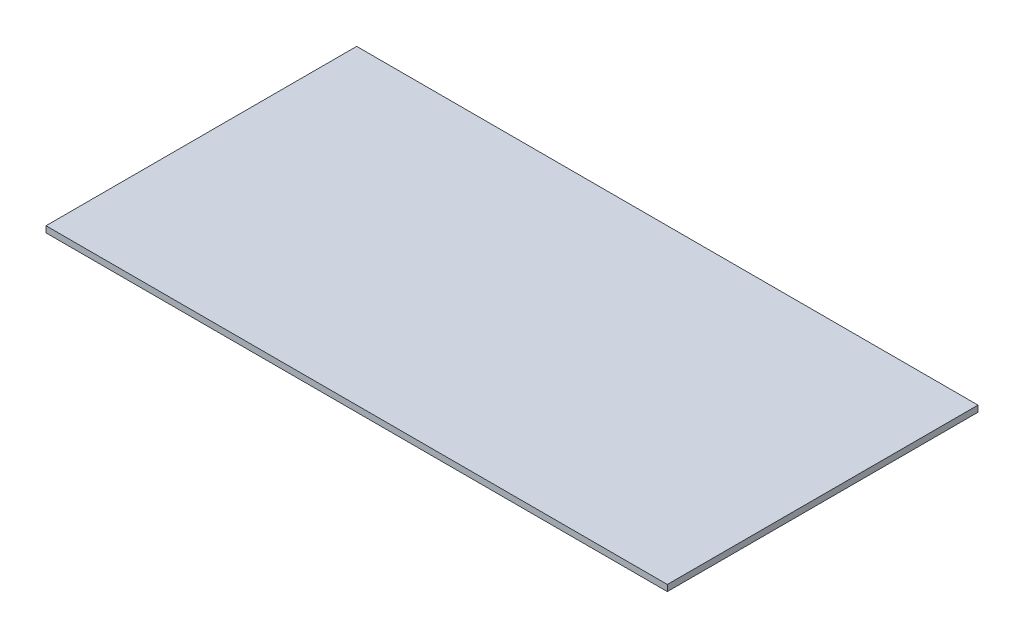
ISO-10303-21;
HEADER;
FILE_DESCRIPTION(('STEP AP214'),'2;1');
FILE_NAME('part.step','',(''),(''),'','','');
FILE_SCHEMA(('AUTOMOTIVE_DESIGN { 1 0 10303 214 1 1 1 1 }'));
ENDSEC;
DATA;
#1=APPLICATION_CONTEXT('core data for automotive mechanical design processes');
#2=APPLICATION_PROTOCOL_DEFINITION('international standard','automotive_design',2000,#1);
#3=PRODUCT_CONTEXT('',#1,'mechanical');
#4=PRODUCT('Part','Part','',(#3));
#5=PRODUCT_RELATED_PRODUCT_CATEGORY('part','',(#4));
#6=PRODUCT_DEFINITION_FORMATION('','',#4);
#7=PRODUCT_DEFINITION_CONTEXT('part definition',#1,'design');
#8=PRODUCT_DEFINITION('design','',#6,#7);
#9=PRODUCT_DEFINITION_SHAPE('','',#8);
#10=(LENGTH_UNIT() NAMED_UNIT(*) SI_UNIT(.MILLI.,.METRE.));
#11=(NAMED_UNIT(*) PLANE_ANGLE_UNIT() SI_UNIT($,.RADIAN.));
#12=(NAMED_UNIT(*) SI_UNIT($,.STERADIAN.) SOLID_ANGLE_UNIT());
#13=UNCERTAINTY_MEASURE_WITH_UNIT(LENGTH_MEASURE(1.E-05),#10,'distance_accuracy_value','');
#14=(GEOMETRIC_REPRESENTATION_CONTEXT(3) GLOBAL_UNCERTAINTY_ASSIGNED_CONTEXT((#13)) GLOBAL_UNIT_ASSIGNED_CONTEXT((#10,
#11,#12)) REPRESENTATION_CONTEXT('',''));
#15=CARTESIAN_POINT('',(0.,0.,0.));
#16=DIRECTION('',(0.,0.,1.));
#17=DIRECTION('',(1.,0.,0.));
#18=AXIS2_PLACEMENT_3D('',#15,#16,#17);
#19=CARTESIAN_POINT('',(500.,10.,-250.));
#20=DIRECTION('',(-1.,0.,0.));
#21=DIRECTION('',(0.,0.,1.));
#22=AXIS2_PLACEMENT_3D('',#19,#20,#21);
#23=PLANE('',#22);
#24=DIRECTION('',(0.,0.,-1.));
#25=VECTOR('',#24,1.);
#26=CARTESIAN_POINT('',(500.,0.,-250.));
#27=LINE('',#26,#25);
#28=CARTESIAN_POINT('',(500.,0.,250.));
#29=VERTEX_POINT('',#28);
#30=CARTESIAN_POINT('',(500.,0.,-250.));
#31=VERTEX_POINT('',#30);
#32=EDGE_CURVE('E100',#29,#31,#27,.T.);
#33=ORIENTED_EDGE('',*,*,#32,.T.);
#34=DIRECTION('',(0.,-1.,0.));
#35=VECTOR('',#34,1.);
#36=CARTESIAN_POINT('',(500.,10.,-250.));
#37=LINE('',#36,#35);
#38=CARTESIAN_POINT('',(500.,10.,-250.));
#39=VERTEX_POINT('',#38);
#40=EDGE_CURVE('E11',#39,#31,#37,.T.);
#41=ORIENTED_EDGE('',*,*,#40,.F.);
#42=DIRECTION('',(0.,0.,-1.));
#43=VECTOR('',#42,1.);
#44=CARTESIAN_POINT('',(500.,10.,-250.));
#45=LINE('',#44,#43);
#46=CARTESIAN_POINT('',(500.,10.,250.));
#47=VERTEX_POINT('',#46);
#48=EDGE_CURVE('E88',#47,#39,#45,.T.);
#49=ORIENTED_EDGE('',*,*,#48,.F.);
#50=DIRECTION('',(0.,-1.,0.));
#51=VECTOR('',#50,1.);
#52=CARTESIAN_POINT('',(500.,10.,250.));
#53=LINE('',#52,#51);
#54=EDGE_CURVE('E96',#47,#29,#53,.T.);
#55=ORIENTED_EDGE('',*,*,#54,.T.);
#56=EDGE_LOOP('',(#33,#41,#49,#55));
#57=FACE_BOUND('',#56,.T.);
#58=ADVANCED_FACE('F37',(#57),#23,.F.);
#59=CARTESIAN_POINT('',(-500.,10.,-250.));
#60=DIRECTION('',(0.,0.,1.));
#61=DIRECTION('',(1.,0.,0.));
#62=AXIS2_PLACEMENT_3D('',#59,#60,#61);
#63=PLANE('',#62);
#64=DIRECTION('',(-1.,0.,0.));
#65=VECTOR('',#64,1.);
#66=CARTESIAN_POINT('',(-500.,0.,-250.));
#67=LINE('',#66,#65);
#68=CARTESIAN_POINT('',(-500.,0.,-250.));
#69=VERTEX_POINT('',#68);
#70=EDGE_CURVE('E92',#31,#69,#67,.T.);
#71=ORIENTED_EDGE('',*,*,#70,.T.);
#72=DIRECTION('',(0.,-1.,0.));
#73=VECTOR('',#72,1.);
#74=CARTESIAN_POINT('',(-500.,10.,-250.));
#75=LINE('',#74,#73);
#76=CARTESIAN_POINT('',(-500.,10.,-250.));
#77=VERTEX_POINT('',#76);
#78=EDGE_CURVE('E45',#77,#69,#75,.T.);
#79=ORIENTED_EDGE('',*,*,#78,.F.);
#80=DIRECTION('',(-1.,0.,0.));
#81=VECTOR('',#80,1.);
#82=CARTESIAN_POINT('',(-500.,10.,-250.));
#83=LINE('',#82,#81);
#84=EDGE_CURVE('E83',#39,#77,#83,.T.);
#85=ORIENTED_EDGE('',*,*,#84,.F.);
#86=ORIENTED_EDGE('',*,*,#40,.T.);
#87=EDGE_LOOP('',(#71,#79,#85,#86));
#88=FACE_BOUND('',#87,.T.);
#89=ADVANCED_FACE('F91',(#88),#63,.F.);
#90=CARTESIAN_POINT('',(-500.,10.,-250.));
#91=DIRECTION('',(1.,0.,0.));
#92=DIRECTION('',(0.,0.,-1.));
#93=AXIS2_PLACEMENT_3D('',#90,#91,#92);
#94=PLANE('',#93);
#95=DIRECTION('',(0.,0.,1.));
#96=VECTOR('',#95,1.);
#97=CARTESIAN_POINT('',(-500.,0.,-250.));
#98=LINE('',#97,#96);
#99=CARTESIAN_POINT('',(-500.,0.,250.));
#100=VERTEX_POINT('',#99);
#101=EDGE_CURVE('E70',#69,#100,#98,.T.);
#102=ORIENTED_EDGE('',*,*,#101,.T.);
#103=DIRECTION('',(0.,-1.,0.));
#104=VECTOR('',#103,1.);
#105=CARTESIAN_POINT('',(-500.,10.,250.));
#106=LINE('',#105,#104);
#107=CARTESIAN_POINT('',(-500.,10.,250.));
#108=VERTEX_POINT('',#107);
#109=EDGE_CURVE('E93',#108,#100,#106,.T.);
#110=ORIENTED_EDGE('',*,*,#109,.F.);
#111=DIRECTION('',(0.,0.,1.));
#112=VECTOR('',#111,1.);
#113=CARTESIAN_POINT('',(-500.,10.,-250.));
#114=LINE('',#113,#112);
#115=EDGE_CURVE('E86',#77,#108,#114,.T.);
#116=ORIENTED_EDGE('',*,*,#115,.F.);
#117=ORIENTED_EDGE('',*,*,#78,.T.);
#118=EDGE_LOOP('',(#102,#110,#116,#117));
#119=FACE_BOUND('',#118,.T.);
#120=ADVANCED_FACE('F94',(#119),#94,.F.);
#121=CARTESIAN_POINT('',(-500.,10.,250.));
#122=DIRECTION('',(0.,0.,-1.));
#123=DIRECTION('',(-1.,0.,0.));
#124=AXIS2_PLACEMENT_3D('',#121,#122,#123);
#125=PLANE('',#124);
#126=DIRECTION('',(1.,0.,0.));
#127=VECTOR('',#126,1.);
#128=CARTESIAN_POINT('',(-500.,0.,250.));
#129=LINE('',#128,#127);
#130=EDGE_CURVE('E76',#100,#29,#129,.T.);
#131=ORIENTED_EDGE('',*,*,#130,.T.);
#132=ORIENTED_EDGE('',*,*,#54,.F.);
#133=DIRECTION('',(1.,0.,0.));
#134=VECTOR('',#133,1.);
#135=CARTESIAN_POINT('',(-500.,10.,250.));
#136=LINE('',#135,#134);
#137=EDGE_CURVE('E53',#108,#47,#136,.T.);
#138=ORIENTED_EDGE('',*,*,#137,.F.);
#139=ORIENTED_EDGE('',*,*,#109,.T.);
#140=EDGE_LOOP('',(#131,#132,#138,#139));
#141=FACE_BOUND('',#140,.T.);
#142=ADVANCED_FACE('F107',(#141),#125,.F.);
#143=CARTESIAN_POINT('',(0.,10.,0.));
#144=DIRECTION('',(0.,1.,0.));
#145=DIRECTION('',(0.,0.,1.));
#146=AXIS2_PLACEMENT_3D('',#143,#144,#145);
#147=PLANE('',#146);
#148=ORIENTED_EDGE('',*,*,#48,.T.);
#149=ORIENTED_EDGE('',*,*,#84,.T.);
#150=ORIENTED_EDGE('',*,*,#115,.T.);
#151=ORIENTED_EDGE('',*,*,#137,.T.);
#152=EDGE_LOOP('',(#148,#149,#150,#151));
#153=FACE_BOUND('',#152,.T.);
#154=ADVANCED_FACE('F84',(#153),#147,.T.);
#155=CARTESIAN_POINT('',(0.,0.,0.));
#156=DIRECTION('',(0.,1.,0.));
#157=DIRECTION('',(0.,0.,1.));
#158=AXIS2_PLACEMENT_3D('',#155,#156,#157);
#159=PLANE('',#158);
#160=ORIENTED_EDGE('',*,*,#32,.F.);
#161=ORIENTED_EDGE('',*,*,#130,.F.);
#162=ORIENTED_EDGE('',*,*,#101,.F.);
#163=ORIENTED_EDGE('',*,*,#70,.F.);
#164=EDGE_LOOP('',(#160,#161,#162,#163));
#165=FACE_BOUND('',#164,.T.);
#166=ADVANCED_FACE('F110',(#165),#159,.F.);
#167=CLOSED_SHELL('',(#58,#89,#120,#142,#154,#166));
#168=MANIFOLD_SOLID_BREP('B2',#167);
#169=ADVANCED_BREP_SHAPE_REPRESENTATION('',(#18,#168),#14);
#170=SHAPE_DEFINITION_REPRESENTATION(#9,#169);
ENDSEC;
END-ISO-10303-21;
